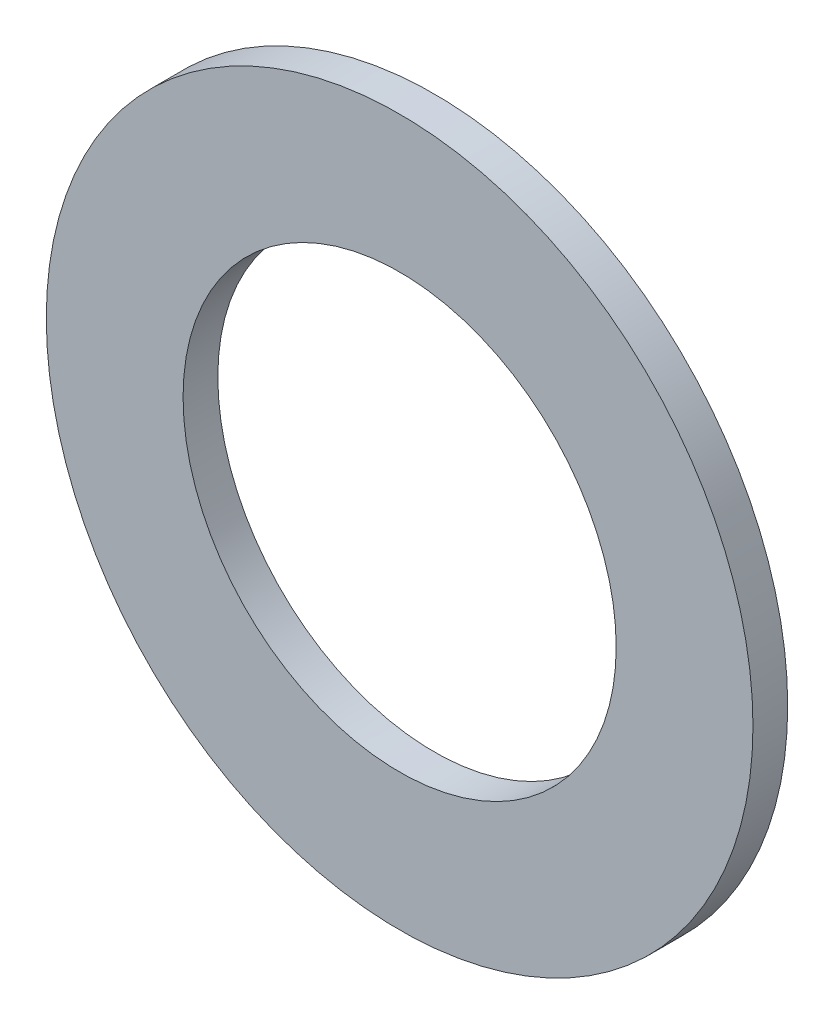
ISO-10303-21;
HEADER;
FILE_DESCRIPTION(('STEP AP214'),'2;1');
FILE_NAME('part.step','',(''),(''),'','','');
FILE_SCHEMA(('AUTOMOTIVE_DESIGN { 1 0 10303 214 1 1 1 1 }'));
ENDSEC;
DATA;
#1=APPLICATION_CONTEXT('core data for automotive mechanical design processes');
#2=APPLICATION_PROTOCOL_DEFINITION('international standard','automotive_design',2000,#1);
#3=PRODUCT_CONTEXT('',#1,'mechanical');
#4=PRODUCT('Part','Part','',(#3));
#5=PRODUCT_RELATED_PRODUCT_CATEGORY('part','',(#4));
#6=PRODUCT_DEFINITION_FORMATION('','',#4);
#7=PRODUCT_DEFINITION_CONTEXT('part definition',#1,'design');
#8=PRODUCT_DEFINITION('design','',#6,#7);
#9=PRODUCT_DEFINITION_SHAPE('','',#8);
#10=(LENGTH_UNIT() NAMED_UNIT(*) SI_UNIT(.MILLI.,.METRE.));
#11=(NAMED_UNIT(*) PLANE_ANGLE_UNIT() SI_UNIT($,.RADIAN.));
#12=(NAMED_UNIT(*) SI_UNIT($,.STERADIAN.) SOLID_ANGLE_UNIT());
#13=UNCERTAINTY_MEASURE_WITH_UNIT(LENGTH_MEASURE(1.E-05),#10,'distance_accuracy_value','');
#14=(GEOMETRIC_REPRESENTATION_CONTEXT(3) GLOBAL_UNCERTAINTY_ASSIGNED_CONTEXT((#13)) GLOBAL_UNIT_ASSIGNED_CONTEXT((#10,
#11,#12)) REPRESENTATION_CONTEXT('',''));
#15=CARTESIAN_POINT('',(0.,0.,0.));
#16=DIRECTION('',(0.,0.,1.));
#17=DIRECTION('',(1.,0.,0.));
#18=AXIS2_PLACEMENT_3D('',#15,#16,#17);
#19=CARTESIAN_POINT('',(0.,0.,0.));
#20=DIRECTION('',(0.,0.,1.));
#21=DIRECTION('',(1.,0.,0.));
#22=AXIS2_PLACEMENT_3D('',#19,#20,#21);
#23=PLANE('',#22);
#24=CARTESIAN_POINT('',(0.,0.,0.));
#25=DIRECTION('',(0.,0.,-1.));
#26=DIRECTION('',(-1.,0.,0.));
#27=AXIS2_PLACEMENT_3D('',#24,#25,#26);
#28=CIRCLE('',#27,9.5);
#29=CARTESIAN_POINT('',(-9.5,0.,0.));
#30=VERTEX_POINT('',#29);
#31=EDGE_CURVE('E26',#30,#30,#28,.F.);
#32=ORIENTED_EDGE('',*,*,#31,.T.);
#33=EDGE_LOOP('',(#32));
#34=FACE_BOUND('',#33,.T.);
#35=CARTESIAN_POINT('',(0.,0.,0.));
#36=DIRECTION('',(0.,0.,-1.));
#37=DIRECTION('',(-1.,0.,0.));
#38=AXIS2_PLACEMENT_3D('',#35,#36,#37);
#39=CIRCLE('',#38,15.5);
#40=CARTESIAN_POINT('',(-15.5,0.,0.));
#41=VERTEX_POINT('',#40);
#42=EDGE_CURVE('E17',#41,#41,#39,.F.);
#43=ORIENTED_EDGE('',*,*,#42,.F.);
#44=EDGE_LOOP('',(#43));
#45=FACE_BOUND('',#44,.T.);
#46=ADVANCED_FACE('F14',(#34,#45),#23,.F.);
#47=CARTESIAN_POINT('',(0.,0.,1.524));
#48=DIRECTION('',(0.,0.,-1.));
#49=DIRECTION('',(-1.,0.,0.));
#50=AXIS2_PLACEMENT_3D('',#47,#48,#49);
#51=CYLINDRICAL_SURFACE('',#50,15.5);
#52=ORIENTED_EDGE('',*,*,#42,.T.);
#53=EDGE_LOOP('',(#52));
#54=FACE_BOUND('',#53,.T.);
#55=CARTESIAN_POINT('',(0.,0.,1.524));
#56=DIRECTION('',(0.,0.,-1.));
#57=DIRECTION('',(-1.,0.,0.));
#58=AXIS2_PLACEMENT_3D('',#55,#56,#57);
#59=CIRCLE('',#58,15.5);
#60=CARTESIAN_POINT('',(-15.5,0.,1.524));
#61=VERTEX_POINT('',#60);
#62=EDGE_CURVE('E21',#61,#61,#59,.F.);
#63=ORIENTED_EDGE('',*,*,#62,.F.);
#64=EDGE_LOOP('',(#63));
#65=FACE_BOUND('',#64,.T.);
#66=ADVANCED_FACE('F34',(#54,#65),#51,.T.);
#67=CARTESIAN_POINT('',(0.,0.,1.524));
#68=DIRECTION('',(0.,0.,-1.));
#69=DIRECTION('',(-1.,0.,0.));
#70=AXIS2_PLACEMENT_3D('',#67,#68,#69);
#71=CYLINDRICAL_SURFACE('',#70,9.5);
#72=CARTESIAN_POINT('',(0.,0.,1.524));
#73=DIRECTION('',(0.,0.,-1.));
#74=DIRECTION('',(-1.,0.,0.));
#75=AXIS2_PLACEMENT_3D('',#72,#73,#74);
#76=CIRCLE('',#75,9.5);
#77=CARTESIAN_POINT('',(-9.5,0.,1.524));
#78=VERTEX_POINT('',#77);
#79=EDGE_CURVE('E10',#78,#78,#76,.T.);
#80=ORIENTED_EDGE('',*,*,#79,.F.);
#81=EDGE_LOOP('',(#80));
#82=FACE_BOUND('',#81,.T.);
#83=ORIENTED_EDGE('',*,*,#31,.F.);
#84=EDGE_LOOP('',(#83));
#85=FACE_BOUND('',#84,.T.);
#86=ADVANCED_FACE('F42',(#82,#85),#71,.F.);
#87=CARTESIAN_POINT('',(0.,0.,1.524));
#88=DIRECTION('',(0.,0.,1.));
#89=DIRECTION('',(1.,0.,0.));
#90=AXIS2_PLACEMENT_3D('',#87,#88,#89);
#91=PLANE('',#90);
#92=ORIENTED_EDGE('',*,*,#79,.T.);
#93=EDGE_LOOP('',(#92));
#94=FACE_BOUND('',#93,.T.);
#95=ORIENTED_EDGE('',*,*,#62,.T.);
#96=EDGE_LOOP('',(#95));
#97=FACE_BOUND('',#96,.T.);
#98=ADVANCED_FACE('F43',(#94,#97),#91,.T.);
#99=CLOSED_SHELL('',(#46,#66,#86,#98));
#100=MANIFOLD_SOLID_BREP('B1',#99);
#101=ADVANCED_BREP_SHAPE_REPRESENTATION('',(#18,#100),#14);
#102=SHAPE_DEFINITION_REPRESENTATION(#9,#101);
ENDSEC;
END-ISO-10303-21;
